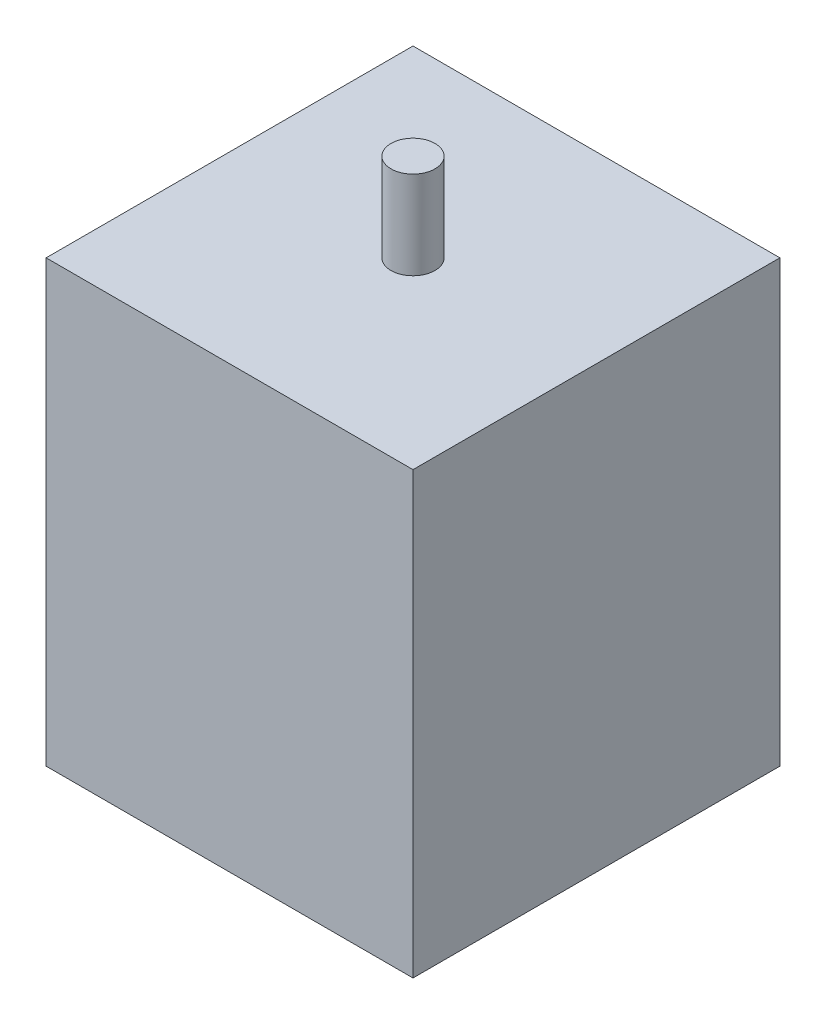
ISO-10303-21;
HEADER;
FILE_DESCRIPTION(('STEP AP214'),'2;1');
FILE_NAME('part.step','',(''),(''),'','','');
FILE_SCHEMA(('AUTOMOTIVE_DESIGN { 1 0 10303 214 1 1 1 1 }'));
ENDSEC;
DATA;
#1=APPLICATION_CONTEXT('core data for automotive mechanical design processes');
#2=APPLICATION_PROTOCOL_DEFINITION('international standard','automotive_design',2000,#1);
#3=PRODUCT_CONTEXT('',#1,'mechanical');
#4=PRODUCT('Part','Part','',(#3));
#5=PRODUCT_RELATED_PRODUCT_CATEGORY('part','',(#4));
#6=PRODUCT_DEFINITION_FORMATION('','',#4);
#7=PRODUCT_DEFINITION_CONTEXT('part definition',#1,'design');
#8=PRODUCT_DEFINITION('design','',#6,#7);
#9=PRODUCT_DEFINITION_SHAPE('','',#8);
#10=(LENGTH_UNIT() NAMED_UNIT(*) SI_UNIT(.MILLI.,.METRE.));
#11=(NAMED_UNIT(*) PLANE_ANGLE_UNIT() SI_UNIT($,.RADIAN.));
#12=(NAMED_UNIT(*) SI_UNIT($,.STERADIAN.) SOLID_ANGLE_UNIT());
#13=UNCERTAINTY_MEASURE_WITH_UNIT(LENGTH_MEASURE(1.E-05),#10,'distance_accuracy_value','');
#14=(GEOMETRIC_REPRESENTATION_CONTEXT(3) GLOBAL_UNCERTAINTY_ASSIGNED_CONTEXT((#13)) GLOBAL_UNIT_ASSIGNED_CONTEXT((#10,
#11,#12)) REPRESENTATION_CONTEXT('',''));
#15=CARTESIAN_POINT('',(0.,0.,0.));
#16=DIRECTION('',(0.,0.,1.));
#17=DIRECTION('',(1.,0.,0.));
#18=AXIS2_PLACEMENT_3D('',#15,#16,#17);
#19=CARTESIAN_POINT('',(25.,60.,25.));
#20=DIRECTION('',(-1.,0.,0.));
#21=DIRECTION('',(0.,0.,1.));
#22=AXIS2_PLACEMENT_3D('',#19,#20,#21);
#23=PLANE('',#22);
#24=DIRECTION('',(0.,0.,-1.));
#25=VECTOR('',#24,1.);
#26=CARTESIAN_POINT('',(25.,0.,25.));
#27=LINE('',#26,#25);
#28=CARTESIAN_POINT('',(25.,0.,25.));
#29=VERTEX_POINT('',#28);
#30=CARTESIAN_POINT('',(25.,0.,-25.));
#31=VERTEX_POINT('',#30);
#32=EDGE_CURVE('E98',#29,#31,#27,.T.);
#33=ORIENTED_EDGE('',*,*,#32,.T.);
#34=DIRECTION('',(0.,-1.,0.));
#35=VECTOR('',#34,1.);
#36=CARTESIAN_POINT('',(25.,60.,-25.));
#37=LINE('',#36,#35);
#38=CARTESIAN_POINT('',(25.,60.,-25.));
#39=VERTEX_POINT('',#38);
#40=EDGE_CURVE('E40',#39,#31,#37,.T.);
#41=ORIENTED_EDGE('',*,*,#40,.F.);
#42=DIRECTION('',(0.,0.,-1.));
#43=VECTOR('',#42,1.);
#44=CARTESIAN_POINT('',(25.,60.,25.));
#45=LINE('',#44,#43);
#46=CARTESIAN_POINT('',(25.,60.,25.));
#47=VERTEX_POINT('',#46);
#48=EDGE_CURVE('E84',#47,#39,#45,.T.);
#49=ORIENTED_EDGE('',*,*,#48,.F.);
#50=DIRECTION('',(0.,-1.,0.));
#51=VECTOR('',#50,1.);
#52=CARTESIAN_POINT('',(25.,60.,25.));
#53=LINE('',#52,#51);
#54=EDGE_CURVE('E94',#47,#29,#53,.T.);
#55=ORIENTED_EDGE('',*,*,#54,.T.);
#56=EDGE_LOOP('',(#33,#41,#49,#55));
#57=FACE_BOUND('',#56,.T.);
#58=ADVANCED_FACE('F32',(#57),#23,.F.);
#59=CARTESIAN_POINT('',(-25.,60.,-25.));
#60=DIRECTION('',(0.,0.,1.));
#61=DIRECTION('',(1.,0.,0.));
#62=AXIS2_PLACEMENT_3D('',#59,#60,#61);
#63=PLANE('',#62);
#64=DIRECTION('',(-1.,0.,0.));
#65=VECTOR('',#64,1.);
#66=CARTESIAN_POINT('',(-25.,0.,-25.));
#67=LINE('',#66,#65);
#68=CARTESIAN_POINT('',(-25.,0.,-25.));
#69=VERTEX_POINT('',#68);
#70=EDGE_CURVE('E89',#31,#69,#67,.T.);
#71=ORIENTED_EDGE('',*,*,#70,.T.);
#72=DIRECTION('',(0.,-1.,0.));
#73=VECTOR('',#72,1.);
#74=CARTESIAN_POINT('',(-25.,60.,-25.));
#75=LINE('',#74,#73);
#76=CARTESIAN_POINT('',(-25.,60.,-25.));
#77=VERTEX_POINT('',#76);
#78=EDGE_CURVE('E87',#77,#69,#75,.T.);
#79=ORIENTED_EDGE('',*,*,#78,.F.);
#80=DIRECTION('',(-1.,0.,0.));
#81=VECTOR('',#80,1.);
#82=CARTESIAN_POINT('',(-25.,60.,-25.));
#83=LINE('',#82,#81);
#84=EDGE_CURVE('E79',#39,#77,#83,.T.);
#85=ORIENTED_EDGE('',*,*,#84,.F.);
#86=ORIENTED_EDGE('',*,*,#40,.T.);
#87=EDGE_LOOP('',(#71,#79,#85,#86));
#88=FACE_BOUND('',#87,.T.);
#89=ADVANCED_FACE('F88',(#88),#63,.F.);
#90=CARTESIAN_POINT('',(-25.,60.,25.));
#91=DIRECTION('',(1.,0.,0.));
#92=DIRECTION('',(0.,0.,-1.));
#93=AXIS2_PLACEMENT_3D('',#90,#91,#92);
#94=PLANE('',#93);
#95=DIRECTION('',(0.,0.,1.));
#96=VECTOR('',#95,1.);
#97=CARTESIAN_POINT('',(-25.,0.,25.));
#98=LINE('',#97,#96);
#99=CARTESIAN_POINT('',(-25.,0.,25.));
#100=VERTEX_POINT('',#99);
#101=EDGE_CURVE('E65',#69,#100,#98,.T.);
#102=ORIENTED_EDGE('',*,*,#101,.T.);
#103=DIRECTION('',(0.,-1.,0.));
#104=VECTOR('',#103,1.);
#105=CARTESIAN_POINT('',(-25.,60.,25.));
#106=LINE('',#105,#104);
#107=CARTESIAN_POINT('',(-25.,60.,25.));
#108=VERTEX_POINT('',#107);
#109=EDGE_CURVE('E90',#108,#100,#106,.T.);
#110=ORIENTED_EDGE('',*,*,#109,.F.);
#111=DIRECTION('',(0.,0.,1.));
#112=VECTOR('',#111,1.);
#113=CARTESIAN_POINT('',(-25.,60.,25.));
#114=LINE('',#113,#112);
#115=EDGE_CURVE('E82',#77,#108,#114,.T.);
#116=ORIENTED_EDGE('',*,*,#115,.F.);
#117=ORIENTED_EDGE('',*,*,#78,.T.);
#118=EDGE_LOOP('',(#102,#110,#116,#117));
#119=FACE_BOUND('',#118,.T.);
#120=ADVANCED_FACE('F92',(#119),#94,.F.);
#121=CARTESIAN_POINT('',(-25.,60.,25.));
#122=DIRECTION('',(0.,0.,-1.));
#123=DIRECTION('',(-1.,0.,0.));
#124=AXIS2_PLACEMENT_3D('',#121,#122,#123);
#125=PLANE('',#124);
#126=DIRECTION('',(1.,0.,0.));
#127=VECTOR('',#126,1.);
#128=CARTESIAN_POINT('',(-25.,0.,25.));
#129=LINE('',#128,#127);
#130=EDGE_CURVE('E71',#100,#29,#129,.T.);
#131=ORIENTED_EDGE('',*,*,#130,.T.);
#132=ORIENTED_EDGE('',*,*,#54,.F.);
#133=DIRECTION('',(1.,0.,0.));
#134=VECTOR('',#133,1.);
#135=CARTESIAN_POINT('',(-25.,60.,25.));
#136=LINE('',#135,#134);
#137=EDGE_CURVE('E48',#108,#47,#136,.T.);
#138=ORIENTED_EDGE('',*,*,#137,.F.);
#139=ORIENTED_EDGE('',*,*,#109,.T.);
#140=EDGE_LOOP('',(#131,#132,#138,#139));
#141=FACE_BOUND('',#140,.T.);
#142=ADVANCED_FACE('F120',(#141),#125,.F.);
#143=CARTESIAN_POINT('',(0.,60.,0.));
#144=DIRECTION('',(0.,-1.,0.));
#145=DIRECTION('',(0.,0.,-1.));
#146=AXIS2_PLACEMENT_3D('',#143,#144,#145);
#147=PLANE('',#146);
#148=CARTESIAN_POINT('',(0.,60.,0.));
#149=DIRECTION('',(0.,-1.,0.));
#150=DIRECTION('',(0.,0.,-1.));
#151=AXIS2_PLACEMENT_3D('',#148,#149,#150);
#152=CIRCLE('',#151,3.);
#153=CARTESIAN_POINT('',(0.,60.,-3.));
#154=VERTEX_POINT('',#153);
#155=EDGE_CURVE('E11',#154,#154,#152,.F.);
#156=ORIENTED_EDGE('',*,*,#155,.F.);
#157=EDGE_LOOP('',(#156));
#158=FACE_BOUND('',#157,.T.);
#159=ORIENTED_EDGE('',*,*,#48,.T.);
#160=ORIENTED_EDGE('',*,*,#84,.T.);
#161=ORIENTED_EDGE('',*,*,#115,.T.);
#162=ORIENTED_EDGE('',*,*,#137,.T.);
#163=EDGE_LOOP('',(#159,#160,#161,#162));
#164=FACE_BOUND('',#163,.T.);
#165=ADVANCED_FACE('F80',(#158,#164),#147,.F.);
#166=CARTESIAN_POINT('',(0.,0.,0.));
#167=DIRECTION('',(0.,-1.,0.));
#168=DIRECTION('',(0.,0.,-1.));
#169=AXIS2_PLACEMENT_3D('',#166,#167,#168);
#170=PLANE('',#169);
#171=ORIENTED_EDGE('',*,*,#32,.F.);
#172=ORIENTED_EDGE('',*,*,#130,.F.);
#173=ORIENTED_EDGE('',*,*,#101,.F.);
#174=ORIENTED_EDGE('',*,*,#70,.F.);
#175=EDGE_LOOP('',(#171,#172,#173,#174));
#176=FACE_BOUND('',#175,.T.);
#177=ADVANCED_FACE('F109',(#176),#170,.T.);
#178=CARTESIAN_POINT('',(0.,72.,0.));
#179=DIRECTION('',(0.,-1.,0.));
#180=DIRECTION('',(0.,0.,-1.));
#181=AXIS2_PLACEMENT_3D('',#178,#179,#180);
#182=CYLINDRICAL_SURFACE('',#181,3.);
#183=CARTESIAN_POINT('',(0.,72.,0.));
#184=DIRECTION('',(0.,1.,0.));
#185=DIRECTION('',(0.,0.,1.));
#186=AXIS2_PLACEMENT_3D('',#183,#184,#185);
#187=CIRCLE('',#186,3.);
#188=CARTESIAN_POINT('',(0.,72.,3.));
#189=VERTEX_POINT('',#188);
#190=EDGE_CURVE('E101',#189,#189,#187,.T.);
#191=ORIENTED_EDGE('',*,*,#190,.F.);
#192=EDGE_LOOP('',(#191));
#193=FACE_BOUND('',#192,.T.);
#194=ORIENTED_EDGE('',*,*,#155,.T.);
#195=EDGE_LOOP('',(#194));
#196=FACE_BOUND('',#195,.T.);
#197=ADVANCED_FACE('F111',(#193,#196),#182,.T.);
#198=CARTESIAN_POINT('',(0.,72.,0.));
#199=DIRECTION('',(0.,1.,0.));
#200=DIRECTION('',(0.,0.,1.));
#201=AXIS2_PLACEMENT_3D('',#198,#199,#200);
#202=PLANE('',#201);
#203=ORIENTED_EDGE('',*,*,#190,.T.);
#204=EDGE_LOOP('',(#203));
#205=FACE_BOUND('',#204,.T.);
#206=ADVANCED_FACE('F117',(#205),#202,.T.);
#207=CLOSED_SHELL('',(#58,#89,#120,#142,#165,#177,#197,#206));
#208=MANIFOLD_SOLID_BREP('B2',#207);
#209=ADVANCED_BREP_SHAPE_REPRESENTATION('',(#18,#208),#14);
#210=SHAPE_DEFINITION_REPRESENTATION(#9,#209);
ENDSEC;
END-ISO-10303-21;
